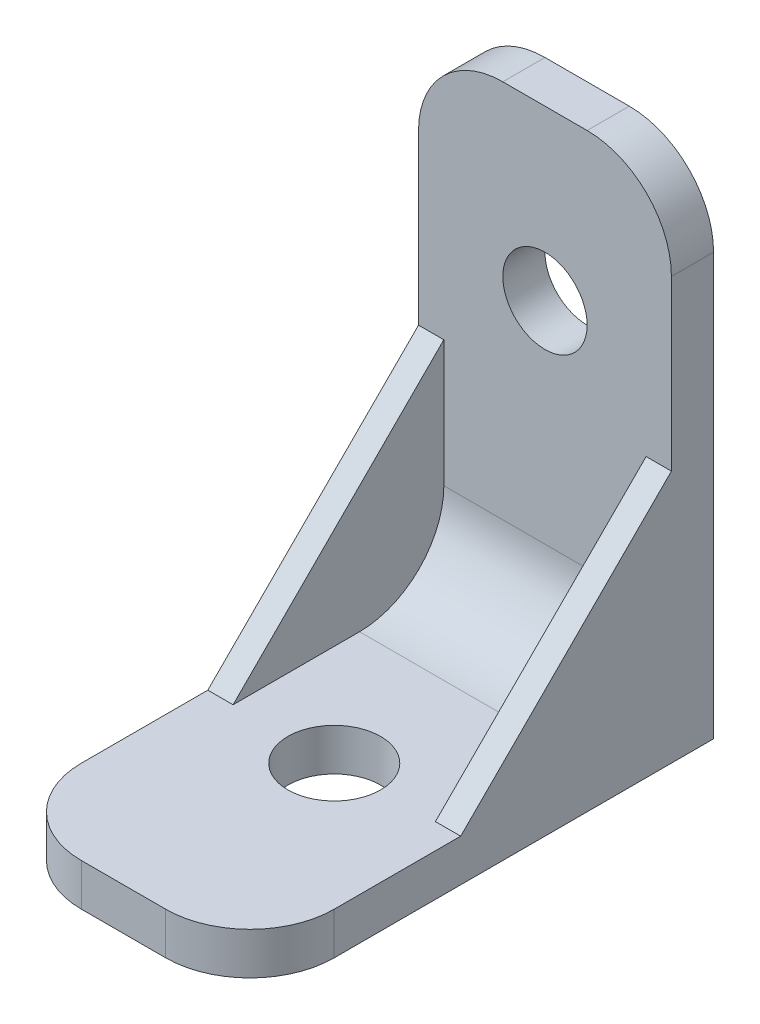
ISO-10303-21;
HEADER;
FILE_DESCRIPTION(('STEP AP214'),'2;1');
FILE_NAME('part.step','',(''),(''),'','','');
FILE_SCHEMA(('AUTOMOTIVE_DESIGN { 1 0 10303 214 1 1 1 1 }'));
ENDSEC;
DATA;
#1=APPLICATION_CONTEXT('core data for automotive mechanical design processes');
#2=APPLICATION_PROTOCOL_DEFINITION('international standard','automotive_design',2000,#1);
#3=PRODUCT_CONTEXT('',#1,'mechanical');
#4=PRODUCT('Part','Part','',(#3));
#5=PRODUCT_RELATED_PRODUCT_CATEGORY('part','',(#4));
#6=PRODUCT_DEFINITION_FORMATION('','',#4);
#7=PRODUCT_DEFINITION_CONTEXT('part definition',#1,'design');
#8=PRODUCT_DEFINITION('design','',#6,#7);
#9=PRODUCT_DEFINITION_SHAPE('','',#8);
#10=(LENGTH_UNIT() NAMED_UNIT(*) SI_UNIT(.MILLI.,.METRE.));
#11=(NAMED_UNIT(*) PLANE_ANGLE_UNIT() SI_UNIT($,.RADIAN.));
#12=(NAMED_UNIT(*) SI_UNIT($,.STERADIAN.) SOLID_ANGLE_UNIT());
#13=UNCERTAINTY_MEASURE_WITH_UNIT(LENGTH_MEASURE(1.E-05),#10,'distance_accuracy_value','');
#14=(GEOMETRIC_REPRESENTATION_CONTEXT(3) GLOBAL_UNCERTAINTY_ASSIGNED_CONTEXT((#13)) GLOBAL_UNIT_ASSIGNED_CONTEXT((#10,
#11,#12)) REPRESENTATION_CONTEXT('',''));
#15=CARTESIAN_POINT('',(0.,0.,0.));
#16=DIRECTION('',(0.,0.,1.));
#17=DIRECTION('',(1.,0.,0.));
#18=AXIS2_PLACEMENT_3D('',#15,#16,#17);
#19=CARTESIAN_POINT('',(15.,5.,5.));
#20=DIRECTION('',(0.,0.,-1.));
#21=DIRECTION('',(0.,1.,0.));
#22=AXIS2_PLACEMENT_3D('',#19,#20,#21);
#23=PLANE('',#22);
#24=CARTESIAN_POINT('',(0.,40.,5.));
#25=DIRECTION('',(0.,0.,1.));
#26=DIRECTION('',(1.,0.,0.));
#27=AXIS2_PLACEMENT_3D('',#24,#25,#26);
#28=CIRCLE('',#27,5.);
#29=CARTESIAN_POINT('',(5.,40.,5.));
#30=VERTEX_POINT('',#29);
#31=EDGE_CURVE('E179',#30,#30,#28,.T.);
#32=ORIENTED_EDGE('',*,*,#31,.F.);
#33=EDGE_LOOP('',(#32));
#34=FACE_BOUND('',#33,.T.);
#35=DIRECTION('',(0.,-1.,0.));
#36=VECTOR('',#35,1.);
#37=CARTESIAN_POINT('',(-12.,30.,5.00000000000001));
#38=LINE('',#37,#36);
#39=CARTESIAN_POINT('',(-12.,30.,5.));
#40=VERTEX_POINT('',#39);
#41=CARTESIAN_POINT('',(-12.,15.,5.));
#42=VERTEX_POINT('',#41);
#43=EDGE_CURVE('E171',#40,#42,#38,.T.);
#44=ORIENTED_EDGE('',*,*,#43,.T.);
#45=DIRECTION('',(-1.,0.,0.));
#46=VECTOR('',#45,1.);
#47=CARTESIAN_POINT('',(12.,15.,5.));
#48=LINE('',#47,#46);
#49=CARTESIAN_POINT('',(12.,15.,5.));
#50=VERTEX_POINT('',#49);
#51=EDGE_CURVE('E43',#42,#50,#48,.F.);
#52=ORIENTED_EDGE('',*,*,#51,.T.);
#53=DIRECTION('',(0.,-1.,0.));
#54=VECTOR('',#53,1.);
#55=CARTESIAN_POINT('',(12.,30.,5.00000000000001));
#56=LINE('',#55,#54);
#57=CARTESIAN_POINT('',(12.,30.,5.00000000000001));
#58=VERTEX_POINT('',#57);
#59=EDGE_CURVE('E144',#58,#50,#56,.T.);
#60=ORIENTED_EDGE('',*,*,#59,.F.);
#61=DIRECTION('',(1.,0.,0.));
#62=VECTOR('',#61,1.);
#63=CARTESIAN_POINT('',(12.,30.,5.00000000000001));
#64=LINE('',#63,#62);
#65=CARTESIAN_POINT('',(15.,30.,5.00000000000001));
#66=VERTEX_POINT('',#65);
#67=EDGE_CURVE('E151',#58,#66,#64,.T.);
#68=ORIENTED_EDGE('',*,*,#67,.T.);
#69=DIRECTION('',(0.,-1.,0.));
#70=VECTOR('',#69,1.);
#71=CARTESIAN_POINT('',(15.,5.,5.));
#72=LINE('',#71,#70);
#73=CARTESIAN_POINT('',(15.,50.,5.));
#74=VERTEX_POINT('',#73);
#75=EDGE_CURVE('E199',#74,#66,#72,.T.);
#76=ORIENTED_EDGE('',*,*,#75,.F.);
#77=CARTESIAN_POINT('',(5.,50.,5.));
#78=DIRECTION('',(0.,0.,-1.));
#79=DIRECTION('',(0.,1.,0.));
#80=AXIS2_PLACEMENT_3D('',#77,#78,#79);
#81=CIRCLE('',#80,10.);
#82=CARTESIAN_POINT('',(5.,60.,5.));
#83=VERTEX_POINT('',#82);
#84=EDGE_CURVE('E230',#74,#83,#81,.F.);
#85=ORIENTED_EDGE('',*,*,#84,.T.);
#86=DIRECTION('',(-1.,0.,0.));
#87=VECTOR('',#86,1.);
#88=CARTESIAN_POINT('',(15.,60.,5.));
#89=LINE('',#88,#87);
#90=CARTESIAN_POINT('',(-5.,60.,5.));
#91=VERTEX_POINT('',#90);
#92=EDGE_CURVE('E213',#83,#91,#89,.T.);
#93=ORIENTED_EDGE('',*,*,#92,.T.);
#94=CARTESIAN_POINT('',(-5.,50.,5.));
#95=DIRECTION('',(0.,0.,-1.));
#96=DIRECTION('',(0.,1.,0.));
#97=AXIS2_PLACEMENT_3D('',#94,#95,#96);
#98=CIRCLE('',#97,10.);
#99=CARTESIAN_POINT('',(-15.,50.,5.));
#100=VERTEX_POINT('',#99);
#101=EDGE_CURVE('E232',#91,#100,#98,.F.);
#102=ORIENTED_EDGE('',*,*,#101,.T.);
#103=DIRECTION('',(0.,-1.,0.));
#104=VECTOR('',#103,1.);
#105=CARTESIAN_POINT('',(-15.,5.,5.));
#106=LINE('',#105,#104);
#107=CARTESIAN_POINT('',(-15.,30.,5.));
#108=VERTEX_POINT('',#107);
#109=EDGE_CURVE('E208',#100,#108,#106,.T.);
#110=ORIENTED_EDGE('',*,*,#109,.T.);
#111=DIRECTION('',(-1.,0.,0.));
#112=VECTOR('',#111,1.);
#113=CARTESIAN_POINT('',(-12.,30.,5.00000000000001));
#114=LINE('',#113,#112);
#115=EDGE_CURVE('E176',#40,#108,#114,.T.);
#116=ORIENTED_EDGE('',*,*,#115,.F.);
#117=EDGE_LOOP('',(#44,#52,#60,#68,#76,#85,#93,#102,#110,#116));
#118=FACE_BOUND('',#117,.T.);
#119=ADVANCED_FACE('F35',(#34,#118),#23,.F.);
#120=CARTESIAN_POINT('',(15.,4.99999999999999,55.));
#121=DIRECTION('',(0.,-1.,0.));
#122=DIRECTION('',(0.,0.,-1.));
#123=AXIS2_PLACEMENT_3D('',#120,#121,#122);
#124=PLANE('',#123);
#125=CARTESIAN_POINT('',(0.,5.,30.));
#126=DIRECTION('',(0.,1.,0.));
#127=DIRECTION('',(0.,0.,1.));
#128=AXIS2_PLACEMENT_3D('',#125,#126,#127);
#129=CIRCLE('',#128,5.5);
#130=CARTESIAN_POINT('',(0.,5.,35.5));
#131=VERTEX_POINT('',#130);
#132=EDGE_CURVE('E186',#131,#131,#129,.T.);
#133=ORIENTED_EDGE('',*,*,#132,.F.);
#134=EDGE_LOOP('',(#133));
#135=FACE_BOUND('',#134,.T.);
#136=DIRECTION('',(0.,0.,1.));
#137=VECTOR('',#136,1.);
#138=CARTESIAN_POINT('',(12.,5.,5.));
#139=LINE('',#138,#137);
#140=CARTESIAN_POINT('',(12.,5.,15.));
#141=VERTEX_POINT('',#140);
#142=CARTESIAN_POINT('',(12.,5.,30.));
#143=VERTEX_POINT('',#142);
#144=EDGE_CURVE('E147',#141,#143,#139,.T.);
#145=ORIENTED_EDGE('',*,*,#144,.F.);
#146=DIRECTION('',(-1.,0.,0.));
#147=VECTOR('',#146,1.);
#148=CARTESIAN_POINT('',(-12.,5.,15.));
#149=LINE('',#148,#147);
#150=CARTESIAN_POINT('',(-12.,5.,15.));
#151=VERTEX_POINT('',#150);
#152=EDGE_CURVE('E263',#141,#151,#149,.T.);
#153=ORIENTED_EDGE('',*,*,#152,.T.);
#154=DIRECTION('',(0.,0.,1.));
#155=VECTOR('',#154,1.);
#156=CARTESIAN_POINT('',(-12.,5.,5.));
#157=LINE('',#156,#155);
#158=CARTESIAN_POINT('',(-12.,5.,30.));
#159=VERTEX_POINT('',#158);
#160=EDGE_CURVE('E166',#151,#159,#157,.T.);
#161=ORIENTED_EDGE('',*,*,#160,.T.);
#162=DIRECTION('',(-1.,0.,0.));
#163=VECTOR('',#162,1.);
#164=CARTESIAN_POINT('',(-12.,5.,30.));
#165=LINE('',#164,#163);
#166=CARTESIAN_POINT('',(-15.,4.99999999999999,30.));
#167=VERTEX_POINT('',#166);
#168=EDGE_CURVE('E173',#159,#167,#165,.T.);
#169=ORIENTED_EDGE('',*,*,#168,.T.);
#170=DIRECTION('',(0.,0.,1.));
#171=VECTOR('',#170,1.);
#172=CARTESIAN_POINT('',(-15.,4.99999999999999,55.));
#173=LINE('',#172,#171);
#174=CARTESIAN_POINT('',(-15.,4.99999999999999,45.));
#175=VERTEX_POINT('',#174);
#176=EDGE_CURVE('E196',#167,#175,#173,.T.);
#177=ORIENTED_EDGE('',*,*,#176,.T.);
#178=CARTESIAN_POINT('',(-5.,4.99999999999999,45.));
#179=DIRECTION('',(0.,-1.,0.));
#180=DIRECTION('',(0.,0.,-1.));
#181=AXIS2_PLACEMENT_3D('',#178,#179,#180);
#182=CIRCLE('',#181,10.);
#183=CARTESIAN_POINT('',(-5.,4.99999999999999,55.));
#184=VERTEX_POINT('',#183);
#185=EDGE_CURVE('E261',#175,#184,#182,.F.);
#186=ORIENTED_EDGE('',*,*,#185,.T.);
#187=DIRECTION('',(-1.,0.,0.));
#188=VECTOR('',#187,1.);
#189=CARTESIAN_POINT('',(15.,4.99999999999999,55.));
#190=LINE('',#189,#188);
#191=CARTESIAN_POINT('',(5.,4.99999999999999,55.));
#192=VERTEX_POINT('',#191);
#193=EDGE_CURVE('E203',#192,#184,#190,.T.);
#194=ORIENTED_EDGE('',*,*,#193,.F.);
#195=CARTESIAN_POINT('',(5.,4.99999999999999,45.));
#196=DIRECTION('',(0.,-1.,0.));
#197=DIRECTION('',(0.,0.,-1.));
#198=AXIS2_PLACEMENT_3D('',#195,#196,#197);
#199=CIRCLE('',#198,10.);
#200=CARTESIAN_POINT('',(15.,4.99999999999999,45.));
#201=VERTEX_POINT('',#200);
#202=EDGE_CURVE('E258',#192,#201,#199,.F.);
#203=ORIENTED_EDGE('',*,*,#202,.T.);
#204=DIRECTION('',(0.,0.,1.));
#205=VECTOR('',#204,1.);
#206=CARTESIAN_POINT('',(15.,4.99999999999999,55.));
#207=LINE('',#206,#205);
#208=CARTESIAN_POINT('',(15.,5.,30.));
#209=VERTEX_POINT('',#208);
#210=EDGE_CURVE('E201',#209,#201,#207,.T.);
#211=ORIENTED_EDGE('',*,*,#210,.F.);
#212=DIRECTION('',(1.,0.,0.));
#213=VECTOR('',#212,1.);
#214=CARTESIAN_POINT('',(12.,5.,30.));
#215=LINE('',#214,#213);
#216=EDGE_CURVE('E158',#143,#209,#215,.T.);
#217=ORIENTED_EDGE('',*,*,#216,.F.);
#218=EDGE_LOOP('',(#145,#153,#161,#169,#177,#186,#194,#203,#211,#217));
#219=FACE_BOUND('',#218,.T.);
#220=ADVANCED_FACE('F268',(#135,#219),#124,.F.);
#221=CARTESIAN_POINT('',(15.,0.,55.));
#222=DIRECTION('',(0.,0.,-1.));
#223=DIRECTION('',(-1.,0.,0.));
#224=AXIS2_PLACEMENT_3D('',#221,#222,#223);
#225=PLANE('',#224);
#226=ORIENTED_EDGE('',*,*,#193,.T.);
#227=DIRECTION('',(0.,-1.,0.));
#228=VECTOR('',#227,1.);
#229=CARTESIAN_POINT('',(-5.,0.,55.));
#230=LINE('',#229,#228);
#231=CARTESIAN_POINT('',(-5.,0.,55.));
#232=VERTEX_POINT('',#231);
#233=EDGE_CURVE('E251',#184,#232,#230,.T.);
#234=ORIENTED_EDGE('',*,*,#233,.T.);
#235=DIRECTION('',(-1.,0.,0.));
#236=VECTOR('',#235,1.);
#237=CARTESIAN_POINT('',(15.,0.,55.));
#238=LINE('',#237,#236);
#239=CARTESIAN_POINT('',(5.,0.,55.));
#240=VERTEX_POINT('',#239);
#241=EDGE_CURVE('E222',#240,#232,#238,.T.);
#242=ORIENTED_EDGE('',*,*,#241,.F.);
#243=DIRECTION('',(0.,-1.,0.));
#244=VECTOR('',#243,1.);
#245=CARTESIAN_POINT('',(5.,0.,55.));
#246=LINE('',#245,#244);
#247=EDGE_CURVE('E249',#240,#192,#246,.F.);
#248=ORIENTED_EDGE('',*,*,#247,.T.);
#249=EDGE_LOOP('',(#226,#234,#242,#248));
#250=FACE_BOUND('',#249,.T.);
#251=ADVANCED_FACE('F290',(#250),#225,.F.);
#252=CARTESIAN_POINT('',(15.,0.,0.));
#253=DIRECTION('',(0.,1.,0.));
#254=DIRECTION('',(0.,0.,1.));
#255=AXIS2_PLACEMENT_3D('',#252,#253,#254);
#256=PLANE('',#255);
#257=CARTESIAN_POINT('',(0.,0.,30.));
#258=DIRECTION('',(0.,1.,0.));
#259=DIRECTION('',(0.,0.,1.));
#260=AXIS2_PLACEMENT_3D('',#257,#258,#259);
#261=CIRCLE('',#260,5.5);
#262=CARTESIAN_POINT('',(0.,0.,35.5));
#263=VERTEX_POINT('',#262);
#264=EDGE_CURVE('E189',#263,#263,#261,.T.);
#265=ORIENTED_EDGE('',*,*,#264,.T.);
#266=EDGE_LOOP('',(#265));
#267=FACE_BOUND('',#266,.T.);
#268=ORIENTED_EDGE('',*,*,#241,.T.);
#269=CARTESIAN_POINT('',(-5.,0.,45.));
#270=DIRECTION('',(0.,1.,0.));
#271=DIRECTION('',(0.,0.,1.));
#272=AXIS2_PLACEMENT_3D('',#269,#270,#271);
#273=CIRCLE('',#272,10.);
#274=CARTESIAN_POINT('',(-15.,0.,45.));
#275=VERTEX_POINT('',#274);
#276=EDGE_CURVE('E256',#232,#275,#273,.F.);
#277=ORIENTED_EDGE('',*,*,#276,.T.);
#278=DIRECTION('',(0.,0.,-1.));
#279=VECTOR('',#278,1.);
#280=CARTESIAN_POINT('',(-15.,0.,0.));
#281=LINE('',#280,#279);
#282=CARTESIAN_POINT('',(-15.,0.,0.));
#283=VERTEX_POINT('',#282);
#284=EDGE_CURVE('E192',#275,#283,#281,.T.);
#285=ORIENTED_EDGE('',*,*,#284,.T.);
#286=DIRECTION('',(-1.,0.,0.));
#287=VECTOR('',#286,1.);
#288=CARTESIAN_POINT('',(15.,0.,0.));
#289=LINE('',#288,#287);
#290=CARTESIAN_POINT('',(15.,0.,0.));
#291=VERTEX_POINT('',#290);
#292=EDGE_CURVE('E219',#291,#283,#289,.T.);
#293=ORIENTED_EDGE('',*,*,#292,.F.);
#294=DIRECTION('',(0.,0.,-1.));
#295=VECTOR('',#294,1.);
#296=CARTESIAN_POINT('',(15.,0.,0.));
#297=LINE('',#296,#295);
#298=CARTESIAN_POINT('',(15.,0.,45.));
#299=VERTEX_POINT('',#298);
#300=EDGE_CURVE('E193',#299,#291,#297,.T.);
#301=ORIENTED_EDGE('',*,*,#300,.F.);
#302=CARTESIAN_POINT('',(5.,0.,45.));
#303=DIRECTION('',(0.,1.,0.));
#304=DIRECTION('',(0.,0.,1.));
#305=AXIS2_PLACEMENT_3D('',#302,#303,#304);
#306=CIRCLE('',#305,10.);
#307=EDGE_CURVE('E254',#299,#240,#306,.F.);
#308=ORIENTED_EDGE('',*,*,#307,.T.);
#309=EDGE_LOOP('',(#268,#277,#285,#293,#301,#308));
#310=FACE_BOUND('',#309,.T.);
#311=ADVANCED_FACE('F315',(#267,#310),#256,.F.);
#312=CARTESIAN_POINT('',(15.,60.,0.));
#313=DIRECTION('',(0.,0.,1.));
#314=DIRECTION('',(0.,-1.,0.));
#315=AXIS2_PLACEMENT_3D('',#312,#313,#314);
#316=PLANE('',#315);
#317=CARTESIAN_POINT('',(0.,40.,0.));
#318=DIRECTION('',(0.,0.,1.));
#319=DIRECTION('',(0.,-1.,0.));
#320=AXIS2_PLACEMENT_3D('',#317,#318,#319);
#321=CIRCLE('',#320,5.);
#322=CARTESIAN_POINT('',(0.,35.,0.));
#323=VERTEX_POINT('',#322);
#324=EDGE_CURVE('E183',#323,#323,#321,.T.);
#325=ORIENTED_EDGE('',*,*,#324,.T.);
#326=EDGE_LOOP('',(#325));
#327=FACE_BOUND('',#326,.T.);
#328=DIRECTION('',(0.,1.,0.));
#329=VECTOR('',#328,1.);
#330=CARTESIAN_POINT('',(-15.,60.,0.));
#331=LINE('',#330,#329);
#332=CARTESIAN_POINT('',(-15.,50.,0.));
#333=VERTEX_POINT('',#332);
#334=EDGE_CURVE('E205',#283,#333,#331,.T.);
#335=ORIENTED_EDGE('',*,*,#334,.T.);
#336=CARTESIAN_POINT('',(-5.,50.,0.));
#337=DIRECTION('',(0.,0.,1.));
#338=DIRECTION('',(0.,-1.,0.));
#339=AXIS2_PLACEMENT_3D('',#336,#337,#338);
#340=CIRCLE('',#339,10.);
#341=CARTESIAN_POINT('',(-5.,60.,0.));
#342=VERTEX_POINT('',#341);
#343=EDGE_CURVE('E241',#333,#342,#340,.F.);
#344=ORIENTED_EDGE('',*,*,#343,.T.);
#345=DIRECTION('',(-1.,0.,0.));
#346=VECTOR('',#345,1.);
#347=CARTESIAN_POINT('',(15.,60.,0.));
#348=LINE('',#347,#346);
#349=CARTESIAN_POINT('',(5.,60.,0.));
#350=VERTEX_POINT('',#349);
#351=EDGE_CURVE('E216',#350,#342,#348,.T.);
#352=ORIENTED_EDGE('',*,*,#351,.F.);
#353=CARTESIAN_POINT('',(5.,50.,0.));
#354=DIRECTION('',(0.,0.,1.));
#355=DIRECTION('',(0.,-1.,0.));
#356=AXIS2_PLACEMENT_3D('',#353,#354,#355);
#357=CIRCLE('',#356,10.);
#358=CARTESIAN_POINT('',(15.,50.,0.));
#359=VERTEX_POINT('',#358);
#360=EDGE_CURVE('E239',#350,#359,#357,.F.);
#361=ORIENTED_EDGE('',*,*,#360,.T.);
#362=DIRECTION('',(0.,1.,0.));
#363=VECTOR('',#362,1.);
#364=CARTESIAN_POINT('',(15.,60.,0.));
#365=LINE('',#364,#363);
#366=EDGE_CURVE('E195',#291,#359,#365,.T.);
#367=ORIENTED_EDGE('',*,*,#366,.F.);
#368=ORIENTED_EDGE('',*,*,#292,.T.);
#369=EDGE_LOOP('',(#335,#344,#352,#361,#367,#368));
#370=FACE_BOUND('',#369,.T.);
#371=ADVANCED_FACE('F312',(#327,#370),#316,.F.);
#372=CARTESIAN_POINT('',(15.,60.,5.));
#373=DIRECTION('',(0.,-1.,0.));
#374=DIRECTION('',(0.,0.,-1.));
#375=AXIS2_PLACEMENT_3D('',#372,#373,#374);
#376=PLANE('',#375);
#377=ORIENTED_EDGE('',*,*,#351,.T.);
#378=DIRECTION('',(0.,0.,1.));
#379=VECTOR('',#378,1.);
#380=CARTESIAN_POINT('',(-5.,60.,5.));
#381=LINE('',#380,#379);
#382=EDGE_CURVE('E227',#342,#91,#381,.T.);
#383=ORIENTED_EDGE('',*,*,#382,.T.);
#384=ORIENTED_EDGE('',*,*,#92,.F.);
#385=DIRECTION('',(0.,0.,1.));
#386=VECTOR('',#385,1.);
#387=CARTESIAN_POINT('',(5.,60.,5.));
#388=LINE('',#387,#386);
#389=EDGE_CURVE('E225',#83,#350,#388,.F.);
#390=ORIENTED_EDGE('',*,*,#389,.T.);
#391=EDGE_LOOP('',(#377,#383,#384,#390));
#392=FACE_BOUND('',#391,.T.);
#393=ADVANCED_FACE('F305',(#392),#376,.F.);
#394=CARTESIAN_POINT('',(15.,0.,0.));
#395=DIRECTION('',(-1.,0.,0.));
#396=DIRECTION('',(0.,0.,1.));
#397=AXIS2_PLACEMENT_3D('',#394,#395,#396);
#398=PLANE('',#397);
#399=DIRECTION('',(0.,0.707106781186548,-0.707106781186547));
#400=VECTOR('',#399,1.);
#401=CARTESIAN_POINT('',(15.,5.,30.));
#402=LINE('',#401,#400);
#403=EDGE_CURVE('E155',#209,#66,#402,.T.);
#404=ORIENTED_EDGE('',*,*,#403,.F.);
#405=ORIENTED_EDGE('',*,*,#210,.T.);
#406=DIRECTION('',(0.,-1.,0.));
#407=VECTOR('',#406,1.);
#408=CARTESIAN_POINT('',(15.,0.,45.));
#409=LINE('',#408,#407);
#410=EDGE_CURVE('E243',#201,#299,#409,.T.);
#411=ORIENTED_EDGE('',*,*,#410,.T.);
#412=ORIENTED_EDGE('',*,*,#300,.T.);
#413=ORIENTED_EDGE('',*,*,#366,.T.);
#414=DIRECTION('',(0.,0.,1.));
#415=VECTOR('',#414,1.);
#416=CARTESIAN_POINT('',(15.,50.,0.));
#417=LINE('',#416,#415);
#418=EDGE_CURVE('E246',#359,#74,#417,.T.);
#419=ORIENTED_EDGE('',*,*,#418,.T.);
#420=ORIENTED_EDGE('',*,*,#75,.T.);
#421=EDGE_LOOP('',(#404,#405,#411,#412,#413,#419,#420));
#422=FACE_BOUND('',#421,.T.);
#423=ADVANCED_FACE('F298',(#422),#398,.F.);
#424=CARTESIAN_POINT('',(-15.,0.,0.));
#425=DIRECTION('',(-1.,0.,0.));
#426=DIRECTION('',(0.,0.,1.));
#427=AXIS2_PLACEMENT_3D('',#424,#425,#426);
#428=PLANE('',#427);
#429=ORIENTED_EDGE('',*,*,#176,.F.);
#430=DIRECTION('',(0.,0.707106781186548,-0.707106781186547));
#431=VECTOR('',#430,1.);
#432=CARTESIAN_POINT('',(-15.,5.,30.));
#433=LINE('',#432,#431);
#434=EDGE_CURVE('E164',#167,#108,#433,.T.);
#435=ORIENTED_EDGE('',*,*,#434,.T.);
#436=ORIENTED_EDGE('',*,*,#109,.F.);
#437=DIRECTION('',(0.,0.,1.));
#438=VECTOR('',#437,1.);
#439=CARTESIAN_POINT('',(-15.,50.,0.));
#440=LINE('',#439,#438);
#441=EDGE_CURVE('E237',#100,#333,#440,.F.);
#442=ORIENTED_EDGE('',*,*,#441,.T.);
#443=ORIENTED_EDGE('',*,*,#334,.F.);
#444=ORIENTED_EDGE('',*,*,#284,.F.);
#445=DIRECTION('',(0.,-1.,0.));
#446=VECTOR('',#445,1.);
#447=CARTESIAN_POINT('',(-15.,4.99999999999999,45.));
#448=LINE('',#447,#446);
#449=EDGE_CURVE('E234',#275,#175,#448,.F.);
#450=ORIENTED_EDGE('',*,*,#449,.T.);
#451=EDGE_LOOP('',(#429,#435,#436,#442,#443,#444,#450));
#452=FACE_BOUND('',#451,.T.);
#453=ADVANCED_FACE('F278',(#452),#428,.T.);
#454=CARTESIAN_POINT('',(0.,-25.,30.));
#455=DIRECTION('',(0.,1.,0.));
#456=DIRECTION('',(0.,0.,1.));
#457=AXIS2_PLACEMENT_3D('',#454,#455,#456);
#458=CYLINDRICAL_SURFACE('',#457,5.5);
#459=ORIENTED_EDGE('',*,*,#132,.T.);
#460=EDGE_LOOP('',(#459));
#461=FACE_BOUND('',#460,.T.);
#462=ORIENTED_EDGE('',*,*,#264,.F.);
#463=EDGE_LOOP('',(#462));
#464=FACE_BOUND('',#463,.T.);
#465=ADVANCED_FACE('F365',(#461,#464),#458,.F.);
#466=CARTESIAN_POINT('',(0.,40.,-25.));
#467=DIRECTION('',(0.,0.,1.));
#468=DIRECTION('',(1.,0.,0.));
#469=AXIS2_PLACEMENT_3D('',#466,#467,#468);
#470=CYLINDRICAL_SURFACE('',#469,5.);
#471=ORIENTED_EDGE('',*,*,#31,.T.);
#472=EDGE_LOOP('',(#471));
#473=FACE_BOUND('',#472,.T.);
#474=ORIENTED_EDGE('',*,*,#324,.F.);
#475=EDGE_LOOP('',(#474));
#476=FACE_BOUND('',#475,.T.);
#477=ADVANCED_FACE('F348',(#473,#476),#470,.F.);
#478=CARTESIAN_POINT('',(-5.,50.,5.));
#479=DIRECTION('',(0.,0.,-1.));
#480=DIRECTION('',(-1.,0.,0.));
#481=AXIS2_PLACEMENT_3D('',#478,#479,#480);
#482=CYLINDRICAL_SURFACE('',#481,10.);
#483=ORIENTED_EDGE('',*,*,#343,.F.);
#484=ORIENTED_EDGE('',*,*,#441,.F.);
#485=ORIENTED_EDGE('',*,*,#101,.F.);
#486=ORIENTED_EDGE('',*,*,#382,.F.);
#487=EDGE_LOOP('',(#483,#484,#485,#486));
#488=FACE_BOUND('',#487,.T.);
#489=ADVANCED_FACE('F319',(#488),#482,.T.);
#490=CARTESIAN_POINT('',(5.,50.,0.));
#491=DIRECTION('',(0.,0.,1.));
#492=DIRECTION('',(1.,0.,0.));
#493=AXIS2_PLACEMENT_3D('',#490,#491,#492);
#494=CYLINDRICAL_SURFACE('',#493,10.);
#495=ORIENTED_EDGE('',*,*,#360,.F.);
#496=ORIENTED_EDGE('',*,*,#389,.F.);
#497=ORIENTED_EDGE('',*,*,#84,.F.);
#498=ORIENTED_EDGE('',*,*,#418,.F.);
#499=EDGE_LOOP('',(#495,#496,#497,#498));
#500=FACE_BOUND('',#499,.T.);
#501=ADVANCED_FACE('F309',(#500),#494,.T.);
#502=CARTESIAN_POINT('',(-5.,0.,45.));
#503=DIRECTION('',(0.,1.,0.));
#504=DIRECTION('',(0.,0.,1.));
#505=AXIS2_PLACEMENT_3D('',#502,#503,#504);
#506=CYLINDRICAL_SURFACE('',#505,10.);
#507=ORIENTED_EDGE('',*,*,#185,.F.);
#508=ORIENTED_EDGE('',*,*,#449,.F.);
#509=ORIENTED_EDGE('',*,*,#276,.F.);
#510=ORIENTED_EDGE('',*,*,#233,.F.);
#511=EDGE_LOOP('',(#507,#508,#509,#510));
#512=FACE_BOUND('',#511,.T.);
#513=ADVANCED_FACE('F286',(#512),#506,.T.);
#514=CARTESIAN_POINT('',(5.,0.,45.));
#515=DIRECTION('',(0.,-1.,0.));
#516=DIRECTION('',(0.,0.,-1.));
#517=AXIS2_PLACEMENT_3D('',#514,#515,#516);
#518=CYLINDRICAL_SURFACE('',#517,10.);
#519=ORIENTED_EDGE('',*,*,#202,.F.);
#520=ORIENTED_EDGE('',*,*,#247,.F.);
#521=ORIENTED_EDGE('',*,*,#307,.F.);
#522=ORIENTED_EDGE('',*,*,#410,.F.);
#523=EDGE_LOOP('',(#519,#520,#521,#522));
#524=FACE_BOUND('',#523,.T.);
#525=ADVANCED_FACE('F294',(#524),#518,.T.);
#526=CARTESIAN_POINT('',(-12.,5.,30.));
#527=DIRECTION('',(0.,0.707106781186547,0.707106781186548));
#528=DIRECTION('',(0.,-0.707106781186548,0.707106781186547));
#529=AXIS2_PLACEMENT_3D('',#526,#527,#528);
#530=PLANE('',#529);
#531=ORIENTED_EDGE('',*,*,#434,.F.);
#532=ORIENTED_EDGE('',*,*,#168,.F.);
#533=DIRECTION('',(0.,0.707106781186548,-0.707106781186547));
#534=VECTOR('',#533,1.);
#535=CARTESIAN_POINT('',(-12.,5.,30.));
#536=LINE('',#535,#534);
#537=EDGE_CURVE('E168',#159,#40,#536,.T.);
#538=ORIENTED_EDGE('',*,*,#537,.T.);
#539=ORIENTED_EDGE('',*,*,#115,.T.);
#540=EDGE_LOOP('',(#531,#532,#538,#539));
#541=FACE_BOUND('',#540,.T.);
#542=ADVANCED_FACE('F275',(#541),#530,.T.);
#543=CARTESIAN_POINT('',(-12.,0.,0.));
#544=DIRECTION('',(1.,0.,0.));
#545=DIRECTION('',(0.,0.,-1.));
#546=AXIS2_PLACEMENT_3D('',#543,#544,#545);
#547=PLANE('',#546);
#548=ORIENTED_EDGE('',*,*,#160,.F.);
#549=CARTESIAN_POINT('',(-12.,15.,15.));
#550=DIRECTION('',(1.,0.,0.));
#551=DIRECTION('',(0.,0.,-1.));
#552=AXIS2_PLACEMENT_3D('',#549,#550,#551);
#553=CIRCLE('',#552,10.);
#554=EDGE_CURVE('E57',#151,#42,#553,.T.);
#555=ORIENTED_EDGE('',*,*,#554,.T.);
#556=ORIENTED_EDGE('',*,*,#43,.F.);
#557=ORIENTED_EDGE('',*,*,#537,.F.);
#558=EDGE_LOOP('',(#548,#555,#556,#557));
#559=FACE_BOUND('',#558,.T.);
#560=ADVANCED_FACE('F272',(#559),#547,.T.);
#561=CARTESIAN_POINT('',(12.,5.,30.));
#562=DIRECTION('',(0.,-0.707106781186547,-0.707106781186548));
#563=DIRECTION('',(0.,0.707106781186548,-0.707106781186547));
#564=AXIS2_PLACEMENT_3D('',#561,#562,#563);
#565=PLANE('',#564);
#566=ORIENTED_EDGE('',*,*,#403,.T.);
#567=ORIENTED_EDGE('',*,*,#67,.F.);
#568=DIRECTION('',(0.,0.707106781186548,-0.707106781186547));
#569=VECTOR('',#568,1.);
#570=CARTESIAN_POINT('',(12.,5.,30.));
#571=LINE('',#570,#569);
#572=EDGE_CURVE('E141',#143,#58,#571,.T.);
#573=ORIENTED_EDGE('',*,*,#572,.F.);
#574=ORIENTED_EDGE('',*,*,#216,.T.);
#575=EDGE_LOOP('',(#566,#567,#573,#574));
#576=FACE_BOUND('',#575,.T.);
#577=ADVANCED_FACE('F154',(#576),#565,.F.);
#578=CARTESIAN_POINT('',(12.,0.,0.));
#579=DIRECTION('',(-1.,0.,0.));
#580=DIRECTION('',(0.,0.,-1.));
#581=AXIS2_PLACEMENT_3D('',#578,#579,#580);
#582=PLANE('',#581);
#583=ORIENTED_EDGE('',*,*,#59,.T.);
#584=CARTESIAN_POINT('',(12.,15.,15.));
#585=DIRECTION('',(-1.,0.,0.));
#586=DIRECTION('',(0.,0.,1.));
#587=AXIS2_PLACEMENT_3D('',#584,#585,#586);
#588=CIRCLE('',#587,10.);
#589=EDGE_CURVE('E11',#50,#141,#588,.T.);
#590=ORIENTED_EDGE('',*,*,#589,.T.);
#591=ORIENTED_EDGE('',*,*,#144,.T.);
#592=ORIENTED_EDGE('',*,*,#572,.T.);
#593=EDGE_LOOP('',(#583,#590,#591,#592));
#594=FACE_BOUND('',#593,.T.);
#595=ADVANCED_FACE('F143',(#594),#582,.T.);
#596=CARTESIAN_POINT('',(15.,15.,15.));
#597=DIRECTION('',(1.,0.,0.));
#598=DIRECTION('',(0.,0.,-1.));
#599=AXIS2_PLACEMENT_3D('',#596,#597,#598);
#600=CYLINDRICAL_SURFACE('',#599,10.);
#601=ORIENTED_EDGE('',*,*,#589,.F.);
#602=ORIENTED_EDGE('',*,*,#51,.F.);
#603=ORIENTED_EDGE('',*,*,#554,.F.);
#604=ORIENTED_EDGE('',*,*,#152,.F.);
#605=EDGE_LOOP('',(#601,#602,#603,#604));
#606=FACE_BOUND('',#605,.T.);
#607=ADVANCED_FACE('F37',(#606),#600,.F.);
#608=CLOSED_SHELL('',(#119,#220,#251,#311,#371,#393,#423,#453,#465,#477,#489,#501,#513,#525,
#542,#560,#577,#595,#607));
#609=MANIFOLD_SOLID_BREP('B2',#608);
#610=ADVANCED_BREP_SHAPE_REPRESENTATION('',(#18,#609),#14);
#611=SHAPE_DEFINITION_REPRESENTATION(#9,#610);
ENDSEC;
END-ISO-10303-21;
